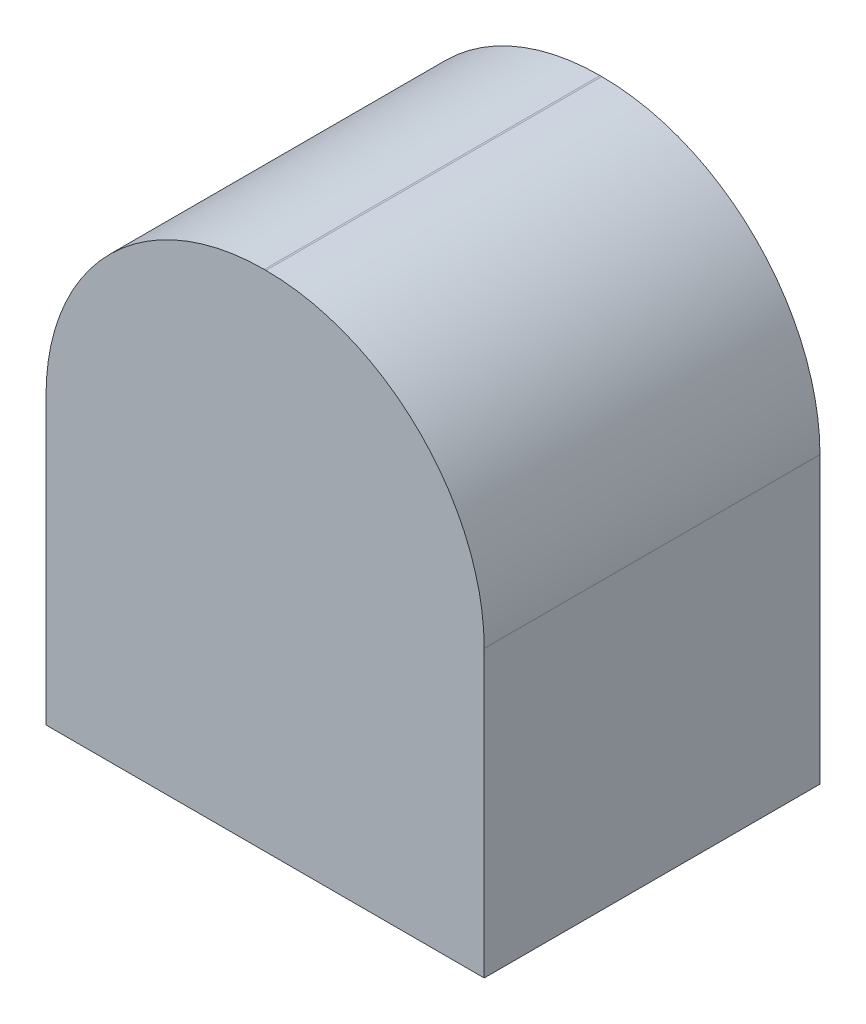
ISO-10303-21;
HEADER;
FILE_DESCRIPTION(('STEP AP214'),'2;1');
FILE_NAME('part.step','',(''),(''),'','','');
FILE_SCHEMA(('AUTOMOTIVE_DESIGN { 1 0 10303 214 1 1 1 1 }'));
ENDSEC;
DATA;
#1=APPLICATION_CONTEXT('core data for automotive mechanical design processes');
#2=APPLICATION_PROTOCOL_DEFINITION('international standard','automotive_design',2000,#1);
#3=PRODUCT_CONTEXT('',#1,'mechanical');
#4=PRODUCT('Part','Part','',(#3));
#5=PRODUCT_RELATED_PRODUCT_CATEGORY('part','',(#4));
#6=PRODUCT_DEFINITION_FORMATION('','',#4);
#7=PRODUCT_DEFINITION_CONTEXT('part definition',#1,'design');
#8=PRODUCT_DEFINITION('design','',#6,#7);
#9=PRODUCT_DEFINITION_SHAPE('','',#8);
#10=(LENGTH_UNIT() NAMED_UNIT(*) SI_UNIT(.MILLI.,.METRE.));
#11=(NAMED_UNIT(*) PLANE_ANGLE_UNIT() SI_UNIT($,.RADIAN.));
#12=(NAMED_UNIT(*) SI_UNIT($,.STERADIAN.) SOLID_ANGLE_UNIT());
#13=UNCERTAINTY_MEASURE_WITH_UNIT(LENGTH_MEASURE(1.E-05),#10,'distance_accuracy_value','');
#14=(GEOMETRIC_REPRESENTATION_CONTEXT(3) GLOBAL_UNCERTAINTY_ASSIGNED_CONTEXT((#13)) GLOBAL_UNIT_ASSIGNED_CONTEXT((#10,
#11,#12)) REPRESENTATION_CONTEXT('',''));
#15=CARTESIAN_POINT('',(0.,0.,0.));
#16=DIRECTION('',(0.,0.,1.));
#17=DIRECTION('',(1.,0.,0.));
#18=AXIS2_PLACEMENT_3D('',#15,#16,#17);
#19=CARTESIAN_POINT('',(0.36949888,0.,0.1999996));
#20=DIRECTION('',(0.,0.,-1.));
#21=DIRECTION('',(-1.,0.,0.));
#22=AXIS2_PLACEMENT_3D('',#19,#20,#21);
#23=PLANE('',#22);
#24=DIRECTION('',(1.,0.,0.));
#25=VECTOR('',#24,1.);
#26=CARTESIAN_POINT('',(0.63049912,0.2999994,0.1999996));
#27=LINE('',#26,#25);
#28=CARTESIAN_POINT('',(0.49949888,0.2999994,0.1999996));
#29=VERTEX_POINT('',#28);
#30=CARTESIAN_POINT('',(0.50049912,0.2999994,0.1999996));
#31=VERTEX_POINT('',#30);
#32=EDGE_CURVE('E11',#29,#31,#27,.T.);
#33=ORIENTED_EDGE('',*,*,#32,.F.);
#34=CARTESIAN_POINT('',(0.49949888,0.1699994,0.1999996));
#35=DIRECTION('',(0.,0.,-1.));
#36=DIRECTION('',(1.,0.,0.));
#37=AXIS2_PLACEMENT_3D('',#34,#35,#36);
#38=CIRCLE('',#37,0.13);
#39=CARTESIAN_POINT('',(0.36949888,0.1699994,0.1999996));
#40=VERTEX_POINT('',#39);
#41=EDGE_CURVE('E24',#40,#29,#38,.T.);
#42=ORIENTED_EDGE('',*,*,#41,.F.);
#43=DIRECTION('',(0.,1.,0.));
#44=VECTOR('',#43,1.);
#45=CARTESIAN_POINT('',(0.36949888,0.,0.1999996));
#46=LINE('',#45,#44);
#47=CARTESIAN_POINT('',(0.36949888,0.,0.1999996));
#48=VERTEX_POINT('',#47);
#49=EDGE_CURVE('E117',#48,#40,#46,.T.);
#50=ORIENTED_EDGE('',*,*,#49,.F.);
#51=DIRECTION('',(-1.,0.,0.));
#52=VECTOR('',#51,1.);
#53=CARTESIAN_POINT('',(0.36949888,0.,0.1999996));
#54=LINE('',#53,#52);
#55=CARTESIAN_POINT('',(0.63049912,0.,0.1999996));
#56=VERTEX_POINT('',#55);
#57=EDGE_CURVE('E115',#56,#48,#54,.T.);
#58=ORIENTED_EDGE('',*,*,#57,.F.);
#59=DIRECTION('',(0.,-1.,0.));
#60=VECTOR('',#59,1.);
#61=CARTESIAN_POINT('',(0.63049912,0.,0.1999996));
#62=LINE('',#61,#60);
#63=CARTESIAN_POINT('',(0.63049912,0.1699994,0.1999996));
#64=VERTEX_POINT('',#63);
#65=EDGE_CURVE('E73',#64,#56,#62,.T.);
#66=ORIENTED_EDGE('',*,*,#65,.F.);
#67=CARTESIAN_POINT('',(0.50049912,0.1699994,0.1999996));
#68=DIRECTION('',(0.,0.,-1.));
#69=DIRECTION('',(1.,0.,0.));
#70=AXIS2_PLACEMENT_3D('',#67,#68,#69);
#71=CIRCLE('',#70,0.13);
#72=EDGE_CURVE('E111',#31,#64,#71,.T.);
#73=ORIENTED_EDGE('',*,*,#72,.F.);
#74=EDGE_LOOP('',(#33,#42,#50,#58,#66,#73));
#75=FACE_BOUND('',#74,.T.);
#76=ADVANCED_FACE('F17',(#75),#23,.F.);
#77=CARTESIAN_POINT('',(0.50049912,0.1699994,0.));
#78=DIRECTION('',(0.,0.,1.));
#79=DIRECTION('',(1.,0.,0.));
#80=AXIS2_PLACEMENT_3D('',#77,#78,#79);
#81=CYLINDRICAL_SURFACE('',#80,0.13);
#82=ORIENTED_EDGE('',*,*,#72,.T.);
#83=DIRECTION('',(0.,0.,-1.));
#84=VECTOR('',#83,1.);
#85=CARTESIAN_POINT('',(0.63049912,0.1699994,0.));
#86=LINE('',#85,#84);
#87=CARTESIAN_POINT('',(0.63049912,0.1699994,0.));
#88=VERTEX_POINT('',#87);
#89=EDGE_CURVE('E109',#64,#88,#86,.T.);
#90=ORIENTED_EDGE('',*,*,#89,.T.);
#91=CARTESIAN_POINT('',(0.50049912,0.1699994,0.));
#92=DIRECTION('',(0.,0.,1.));
#93=DIRECTION('',(1.,0.,0.));
#94=AXIS2_PLACEMENT_3D('',#91,#92,#93);
#95=CIRCLE('',#94,0.13);
#96=CARTESIAN_POINT('',(0.50049912,0.2999994,0.));
#97=VERTEX_POINT('',#96);
#98=EDGE_CURVE('E89',#88,#97,#95,.T.);
#99=ORIENTED_EDGE('',*,*,#98,.T.);
#100=DIRECTION('',(0.,0.,1.));
#101=VECTOR('',#100,1.);
#102=CARTESIAN_POINT('',(0.50049912,0.2999994,0.));
#103=LINE('',#102,#101);
#104=EDGE_CURVE('E105',#97,#31,#103,.T.);
#105=ORIENTED_EDGE('',*,*,#104,.T.);
#106=EDGE_LOOP('',(#82,#90,#99,#105));
#107=FACE_BOUND('',#106,.T.);
#108=ADVANCED_FACE('F127',(#107),#81,.T.);
#109=CARTESIAN_POINT('',(0.63049912,0.2999994,0.));
#110=DIRECTION('',(0.,-1.,0.));
#111=DIRECTION('',(0.,0.,-1.));
#112=AXIS2_PLACEMENT_3D('',#109,#110,#111);
#113=PLANE('',#112);
#114=DIRECTION('',(1.,0.,0.));
#115=VECTOR('',#114,1.);
#116=CARTESIAN_POINT('',(0.36949888,0.2999994,0.));
#117=LINE('',#116,#115);
#118=CARTESIAN_POINT('',(0.49949888,0.2999994,0.));
#119=VERTEX_POINT('',#118);
#120=EDGE_CURVE('E103',#119,#97,#117,.T.);
#121=ORIENTED_EDGE('',*,*,#120,.F.);
#122=DIRECTION('',(0.,0.,-1.));
#123=VECTOR('',#122,1.);
#124=CARTESIAN_POINT('',(0.49949888,0.2999994,0.));
#125=LINE('',#124,#123);
#126=EDGE_CURVE('E100',#29,#119,#125,.T.);
#127=ORIENTED_EDGE('',*,*,#126,.F.);
#128=ORIENTED_EDGE('',*,*,#32,.T.);
#129=ORIENTED_EDGE('',*,*,#104,.F.);
#130=EDGE_LOOP('',(#121,#127,#128,#129));
#131=FACE_BOUND('',#130,.T.);
#132=ADVANCED_FACE('F123',(#131),#113,.F.);
#133=CARTESIAN_POINT('',(0.49949888,0.1699994,0.));
#134=DIRECTION('',(0.,0.,1.));
#135=DIRECTION('',(1.,0.,0.));
#136=AXIS2_PLACEMENT_3D('',#133,#134,#135);
#137=CYLINDRICAL_SURFACE('',#136,0.13);
#138=ORIENTED_EDGE('',*,*,#41,.T.);
#139=ORIENTED_EDGE('',*,*,#126,.T.);
#140=CARTESIAN_POINT('',(0.49949888,0.1699994,0.));
#141=DIRECTION('',(0.,0.,1.));
#142=DIRECTION('',(1.,0.,0.));
#143=AXIS2_PLACEMENT_3D('',#140,#141,#142);
#144=CIRCLE('',#143,0.13);
#145=CARTESIAN_POINT('',(0.36949888,0.1699994,0.));
#146=VERTEX_POINT('',#145);
#147=EDGE_CURVE('E98',#119,#146,#144,.T.);
#148=ORIENTED_EDGE('',*,*,#147,.T.);
#149=DIRECTION('',(0.,0.,1.));
#150=VECTOR('',#149,1.);
#151=CARTESIAN_POINT('',(0.36949888,0.1699994,0.));
#152=LINE('',#151,#150);
#153=EDGE_CURVE('E95',#146,#40,#152,.T.);
#154=ORIENTED_EDGE('',*,*,#153,.T.);
#155=EDGE_LOOP('',(#138,#139,#148,#154));
#156=FACE_BOUND('',#155,.T.);
#157=ADVANCED_FACE('F120',(#156),#137,.T.);
#158=CARTESIAN_POINT('',(0.36949888,0.2999994,0.));
#159=DIRECTION('',(1.,0.,0.));
#160=DIRECTION('',(0.,0.,-1.));
#161=AXIS2_PLACEMENT_3D('',#158,#159,#160);
#162=PLANE('',#161);
#163=DIRECTION('',(0.,1.,0.));
#164=VECTOR('',#163,1.);
#165=CARTESIAN_POINT('',(0.36949888,0.2999994,0.));
#166=LINE('',#165,#164);
#167=CARTESIAN_POINT('',(0.36949888,0.,0.));
#168=VERTEX_POINT('',#167);
#169=EDGE_CURVE('E93',#168,#146,#166,.T.);
#170=ORIENTED_EDGE('',*,*,#169,.F.);
#171=DIRECTION('',(0.,0.,-1.));
#172=VECTOR('',#171,1.);
#173=CARTESIAN_POINT('',(0.36949888,0.,0.));
#174=LINE('',#173,#172);
#175=EDGE_CURVE('E76',#48,#168,#174,.T.);
#176=ORIENTED_EDGE('',*,*,#175,.F.);
#177=ORIENTED_EDGE('',*,*,#49,.T.);
#178=ORIENTED_EDGE('',*,*,#153,.F.);
#179=EDGE_LOOP('',(#170,#176,#177,#178));
#180=FACE_BOUND('',#179,.T.);
#181=ADVANCED_FACE('F125',(#180),#162,.F.);
#182=CARTESIAN_POINT('',(0.36949888,0.,0.));
#183=DIRECTION('',(0.,1.,0.));
#184=DIRECTION('',(0.,0.,1.));
#185=AXIS2_PLACEMENT_3D('',#182,#183,#184);
#186=PLANE('',#185);
#187=DIRECTION('',(0.,0.,-1.));
#188=VECTOR('',#187,1.);
#189=CARTESIAN_POINT('',(0.63049912,0.,0.));
#190=LINE('',#189,#188);
#191=CARTESIAN_POINT('',(0.63049912,0.,0.));
#192=VERTEX_POINT('',#191);
#193=EDGE_CURVE('E67',#56,#192,#190,.T.);
#194=ORIENTED_EDGE('',*,*,#193,.F.);
#195=ORIENTED_EDGE('',*,*,#57,.T.);
#196=ORIENTED_EDGE('',*,*,#175,.T.);
#197=DIRECTION('',(-1.,0.,0.));
#198=VECTOR('',#197,1.);
#199=CARTESIAN_POINT('',(0.36949888,0.,0.));
#200=LINE('',#199,#198);
#201=EDGE_CURVE('E77',#192,#168,#200,.T.);
#202=ORIENTED_EDGE('',*,*,#201,.F.);
#203=EDGE_LOOP('',(#194,#195,#196,#202));
#204=FACE_BOUND('',#203,.T.);
#205=ADVANCED_FACE('F81',(#204),#186,.F.);
#206=CARTESIAN_POINT('',(0.63049912,0.,0.));
#207=DIRECTION('',(-1.,0.,0.));
#208=DIRECTION('',(0.,0.,1.));
#209=AXIS2_PLACEMENT_3D('',#206,#207,#208);
#210=PLANE('',#209);
#211=DIRECTION('',(0.,-1.,0.));
#212=VECTOR('',#211,1.);
#213=CARTESIAN_POINT('',(0.63049912,0.,0.));
#214=LINE('',#213,#212);
#215=EDGE_CURVE('E72',#88,#192,#214,.T.);
#216=ORIENTED_EDGE('',*,*,#215,.F.);
#217=ORIENTED_EDGE('',*,*,#89,.F.);
#218=ORIENTED_EDGE('',*,*,#65,.T.);
#219=ORIENTED_EDGE('',*,*,#193,.T.);
#220=EDGE_LOOP('',(#216,#217,#218,#219));
#221=FACE_BOUND('',#220,.T.);
#222=ADVANCED_FACE('F69',(#221),#210,.F.);
#223=CARTESIAN_POINT('',(0.36949888,0.,0.));
#224=DIRECTION('',(0.,0.,-1.));
#225=DIRECTION('',(-1.,0.,0.));
#226=AXIS2_PLACEMENT_3D('',#223,#224,#225);
#227=PLANE('',#226);
#228=ORIENTED_EDGE('',*,*,#120,.T.);
#229=ORIENTED_EDGE('',*,*,#98,.F.);
#230=ORIENTED_EDGE('',*,*,#215,.T.);
#231=ORIENTED_EDGE('',*,*,#201,.T.);
#232=ORIENTED_EDGE('',*,*,#169,.T.);
#233=ORIENTED_EDGE('',*,*,#147,.F.);
#234=EDGE_LOOP('',(#228,#229,#230,#231,#232,#233));
#235=FACE_BOUND('',#234,.T.);
#236=ADVANCED_FACE('F88',(#235),#227,.T.);
#237=CLOSED_SHELL('',(#76,#108,#132,#157,#181,#205,#222,#236));
#238=MANIFOLD_SOLID_BREP('B1',#237);
#239=ADVANCED_BREP_SHAPE_REPRESENTATION('',(#18,#238),#14);
#240=SHAPE_DEFINITION_REPRESENTATION(#9,#239);
ENDSEC;
END-ISO-10303-21;
